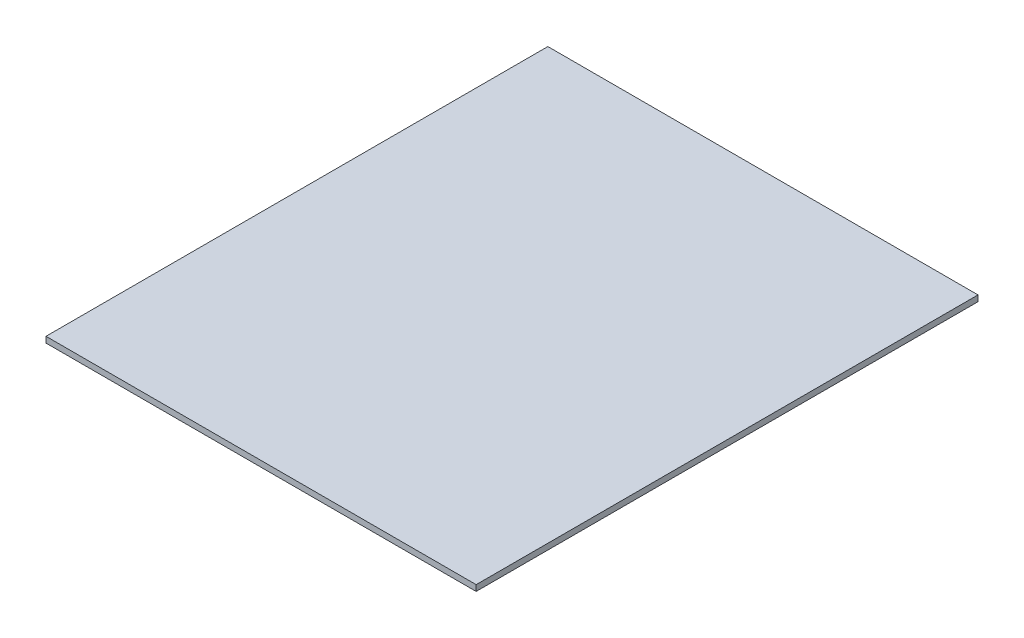
ISO-10303-21;
HEADER;
FILE_DESCRIPTION(('STEP AP214'),'2;1');
FILE_NAME('part.step','',(''),(''),'','','');
FILE_SCHEMA(('AUTOMOTIVE_DESIGN { 1 0 10303 214 1 1 1 1 }'));
ENDSEC;
DATA;
#1=APPLICATION_CONTEXT('core data for automotive mechanical design processes');
#2=APPLICATION_PROTOCOL_DEFINITION('international standard','automotive_design',2000,#1);
#3=PRODUCT_CONTEXT('',#1,'mechanical');
#4=PRODUCT('Part','Part','',(#3));
#5=PRODUCT_RELATED_PRODUCT_CATEGORY('part','',(#4));
#6=PRODUCT_DEFINITION_FORMATION('','',#4);
#7=PRODUCT_DEFINITION_CONTEXT('part definition',#1,'design');
#8=PRODUCT_DEFINITION('design','',#6,#7);
#9=PRODUCT_DEFINITION_SHAPE('','',#8);
#10=(LENGTH_UNIT() NAMED_UNIT(*) SI_UNIT(.MILLI.,.METRE.));
#11=(NAMED_UNIT(*) PLANE_ANGLE_UNIT() SI_UNIT($,.RADIAN.));
#12=(NAMED_UNIT(*) SI_UNIT($,.STERADIAN.) SOLID_ANGLE_UNIT());
#13=UNCERTAINTY_MEASURE_WITH_UNIT(LENGTH_MEASURE(1.E-05),#10,'distance_accuracy_value','');
#14=(GEOMETRIC_REPRESENTATION_CONTEXT(3) GLOBAL_UNCERTAINTY_ASSIGNED_CONTEXT((#13)) GLOBAL_UNIT_ASSIGNED_CONTEXT((#10,
#11,#12)) REPRESENTATION_CONTEXT('',''));
#15=CARTESIAN_POINT('',(0.,0.,0.));
#16=DIRECTION('',(0.,0.,1.));
#17=DIRECTION('',(1.,0.,0.));
#18=AXIS2_PLACEMENT_3D('',#15,#16,#17);
#19=CARTESIAN_POINT('',(60.,1.65,70.));
#20=DIRECTION('',(-1.,0.,0.));
#21=DIRECTION('',(0.,0.,1.));
#22=AXIS2_PLACEMENT_3D('',#19,#20,#21);
#23=PLANE('',#22);
#24=DIRECTION('',(0.,0.,-1.));
#25=VECTOR('',#24,1.);
#26=CARTESIAN_POINT('',(60.,0.,70.));
#27=LINE('',#26,#25);
#28=CARTESIAN_POINT('',(60.,0.,70.));
#29=VERTEX_POINT('',#28);
#30=CARTESIAN_POINT('',(60.,0.,-70.));
#31=VERTEX_POINT('',#30);
#32=EDGE_CURVE('E96',#29,#31,#27,.T.);
#33=ORIENTED_EDGE('',*,*,#32,.T.);
#34=DIRECTION('',(0.,-1.,0.));
#35=VECTOR('',#34,1.);
#36=CARTESIAN_POINT('',(60.,1.65,-70.));
#37=LINE('',#36,#35);
#38=CARTESIAN_POINT('',(60.,1.65,-70.));
#39=VERTEX_POINT('',#38);
#40=EDGE_CURVE('E11',#39,#31,#37,.T.);
#41=ORIENTED_EDGE('',*,*,#40,.F.);
#42=DIRECTION('',(0.,0.,-1.));
#43=VECTOR('',#42,1.);
#44=CARTESIAN_POINT('',(60.,1.65,70.));
#45=LINE('',#44,#43);
#46=CARTESIAN_POINT('',(60.,1.65,70.));
#47=VERTEX_POINT('',#46);
#48=EDGE_CURVE('E84',#47,#39,#45,.T.);
#49=ORIENTED_EDGE('',*,*,#48,.F.);
#50=DIRECTION('',(0.,-1.,0.));
#51=VECTOR('',#50,1.);
#52=CARTESIAN_POINT('',(60.,1.65,70.));
#53=LINE('',#52,#51);
#54=EDGE_CURVE('E92',#47,#29,#53,.T.);
#55=ORIENTED_EDGE('',*,*,#54,.T.);
#56=EDGE_LOOP('',(#33,#41,#49,#55));
#57=FACE_BOUND('',#56,.T.);
#58=ADVANCED_FACE('F33',(#57),#23,.F.);
#59=CARTESIAN_POINT('',(-60.,1.65,-70.));
#60=DIRECTION('',(0.,0.,1.));
#61=DIRECTION('',(1.,0.,0.));
#62=AXIS2_PLACEMENT_3D('',#59,#60,#61);
#63=PLANE('',#62);
#64=DIRECTION('',(-1.,0.,0.));
#65=VECTOR('',#64,1.);
#66=CARTESIAN_POINT('',(-60.,0.,-70.));
#67=LINE('',#66,#65);
#68=CARTESIAN_POINT('',(-60.,0.,-70.));
#69=VERTEX_POINT('',#68);
#70=EDGE_CURVE('E88',#31,#69,#67,.T.);
#71=ORIENTED_EDGE('',*,*,#70,.T.);
#72=DIRECTION('',(0.,-1.,0.));
#73=VECTOR('',#72,1.);
#74=CARTESIAN_POINT('',(-60.,1.65,-70.));
#75=LINE('',#74,#73);
#76=CARTESIAN_POINT('',(-60.,1.65,-70.));
#77=VERTEX_POINT('',#76);
#78=EDGE_CURVE('E41',#77,#69,#75,.T.);
#79=ORIENTED_EDGE('',*,*,#78,.F.);
#80=DIRECTION('',(-1.,0.,0.));
#81=VECTOR('',#80,1.);
#82=CARTESIAN_POINT('',(-60.,1.65,-70.));
#83=LINE('',#82,#81);
#84=EDGE_CURVE('E79',#39,#77,#83,.T.);
#85=ORIENTED_EDGE('',*,*,#84,.F.);
#86=ORIENTED_EDGE('',*,*,#40,.T.);
#87=EDGE_LOOP('',(#71,#79,#85,#86));
#88=FACE_BOUND('',#87,.T.);
#89=ADVANCED_FACE('F87',(#88),#63,.F.);
#90=CARTESIAN_POINT('',(-60.,1.65,70.));
#91=DIRECTION('',(1.,0.,0.));
#92=DIRECTION('',(0.,0.,-1.));
#93=AXIS2_PLACEMENT_3D('',#90,#91,#92);
#94=PLANE('',#93);
#95=DIRECTION('',(0.,0.,1.));
#96=VECTOR('',#95,1.);
#97=CARTESIAN_POINT('',(-60.,0.,70.));
#98=LINE('',#97,#96);
#99=CARTESIAN_POINT('',(-60.,0.,70.));
#100=VERTEX_POINT('',#99);
#101=EDGE_CURVE('E66',#69,#100,#98,.T.);
#102=ORIENTED_EDGE('',*,*,#101,.T.);
#103=DIRECTION('',(0.,-1.,0.));
#104=VECTOR('',#103,1.);
#105=CARTESIAN_POINT('',(-60.,1.65,70.));
#106=LINE('',#105,#104);
#107=CARTESIAN_POINT('',(-60.,1.65,70.));
#108=VERTEX_POINT('',#107);
#109=EDGE_CURVE('E89',#108,#100,#106,.T.);
#110=ORIENTED_EDGE('',*,*,#109,.F.);
#111=DIRECTION('',(0.,0.,1.));
#112=VECTOR('',#111,1.);
#113=CARTESIAN_POINT('',(-60.,1.65,70.));
#114=LINE('',#113,#112);
#115=EDGE_CURVE('E82',#77,#108,#114,.T.);
#116=ORIENTED_EDGE('',*,*,#115,.F.);
#117=ORIENTED_EDGE('',*,*,#78,.T.);
#118=EDGE_LOOP('',(#102,#110,#116,#117));
#119=FACE_BOUND('',#118,.T.);
#120=ADVANCED_FACE('F90',(#119),#94,.F.);
#121=CARTESIAN_POINT('',(-60.,1.65,70.));
#122=DIRECTION('',(0.,0.,-1.));
#123=DIRECTION('',(-1.,0.,0.));
#124=AXIS2_PLACEMENT_3D('',#121,#122,#123);
#125=PLANE('',#124);
#126=DIRECTION('',(1.,0.,0.));
#127=VECTOR('',#126,1.);
#128=CARTESIAN_POINT('',(-60.,0.,70.));
#129=LINE('',#128,#127);
#130=EDGE_CURVE('E72',#100,#29,#129,.T.);
#131=ORIENTED_EDGE('',*,*,#130,.T.);
#132=ORIENTED_EDGE('',*,*,#54,.F.);
#133=DIRECTION('',(1.,0.,0.));
#134=VECTOR('',#133,1.);
#135=CARTESIAN_POINT('',(-60.,1.65,70.));
#136=LINE('',#135,#134);
#137=EDGE_CURVE('E49',#108,#47,#136,.T.);
#138=ORIENTED_EDGE('',*,*,#137,.F.);
#139=ORIENTED_EDGE('',*,*,#109,.T.);
#140=EDGE_LOOP('',(#131,#132,#138,#139));
#141=FACE_BOUND('',#140,.T.);
#142=ADVANCED_FACE('F103',(#141),#125,.F.);
#143=CARTESIAN_POINT('',(0.,1.65,0.));
#144=DIRECTION('',(0.,-1.,0.));
#145=DIRECTION('',(0.,0.,-1.));
#146=AXIS2_PLACEMENT_3D('',#143,#144,#145);
#147=PLANE('',#146);
#148=ORIENTED_EDGE('',*,*,#48,.T.);
#149=ORIENTED_EDGE('',*,*,#84,.T.);
#150=ORIENTED_EDGE('',*,*,#115,.T.);
#151=ORIENTED_EDGE('',*,*,#137,.T.);
#152=EDGE_LOOP('',(#148,#149,#150,#151));
#153=FACE_BOUND('',#152,.T.);
#154=ADVANCED_FACE('F80',(#153),#147,.F.);
#155=CARTESIAN_POINT('',(0.,0.,0.));
#156=DIRECTION('',(0.,-1.,0.));
#157=DIRECTION('',(0.,0.,-1.));
#158=AXIS2_PLACEMENT_3D('',#155,#156,#157);
#159=PLANE('',#158);
#160=ORIENTED_EDGE('',*,*,#32,.F.);
#161=ORIENTED_EDGE('',*,*,#130,.F.);
#162=ORIENTED_EDGE('',*,*,#101,.F.);
#163=ORIENTED_EDGE('',*,*,#70,.F.);
#164=EDGE_LOOP('',(#160,#161,#162,#163));
#165=FACE_BOUND('',#164,.T.);
#166=ADVANCED_FACE('F106',(#165),#159,.T.);
#167=CLOSED_SHELL('',(#58,#89,#120,#142,#154,#166));
#168=MANIFOLD_SOLID_BREP('B2',#167);
#169=ADVANCED_BREP_SHAPE_REPRESENTATION('',(#18,#168),#14);
#170=SHAPE_DEFINITION_REPRESENTATION(#9,#169);
ENDSEC;
END-ISO-10303-21;
